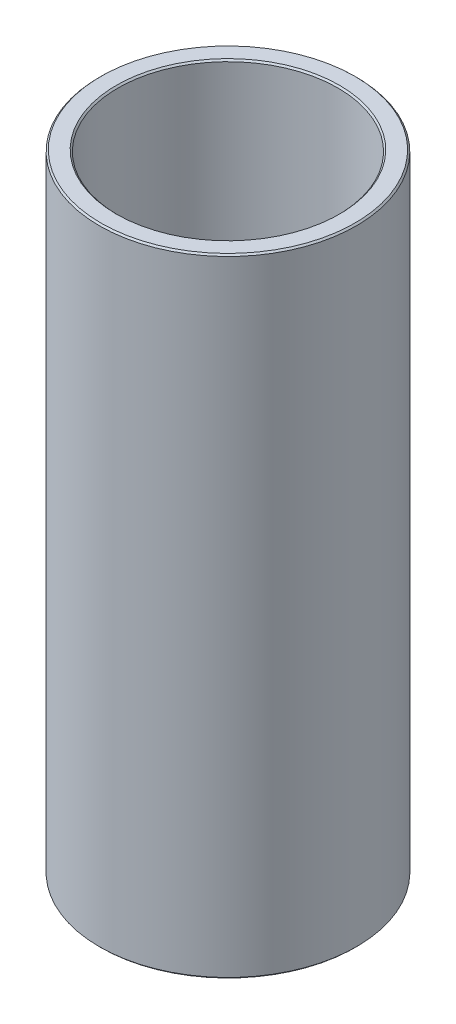
ISO-10303-21;
HEADER;
FILE_DESCRIPTION(('STEP AP214'),'2;1');
FILE_NAME('part.step','',(''),(''),'','','');
FILE_SCHEMA(('AUTOMOTIVE_DESIGN { 1 0 10303 214 1 1 1 1 }'));
ENDSEC;
DATA;
#1=APPLICATION_CONTEXT('core data for automotive mechanical design processes');
#2=APPLICATION_PROTOCOL_DEFINITION('international standard','automotive_design',2000,#1);
#3=PRODUCT_CONTEXT('',#1,'mechanical');
#4=PRODUCT('Part','Part','',(#3));
#5=PRODUCT_RELATED_PRODUCT_CATEGORY('part','',(#4));
#6=PRODUCT_DEFINITION_FORMATION('','',#4);
#7=PRODUCT_DEFINITION_CONTEXT('part definition',#1,'design');
#8=PRODUCT_DEFINITION('design','',#6,#7);
#9=PRODUCT_DEFINITION_SHAPE('','',#8);
#10=(LENGTH_UNIT() NAMED_UNIT(*) SI_UNIT(.MILLI.,.METRE.));
#11=(NAMED_UNIT(*) PLANE_ANGLE_UNIT() SI_UNIT($,.RADIAN.));
#12=(NAMED_UNIT(*) SI_UNIT($,.STERADIAN.) SOLID_ANGLE_UNIT());
#13=UNCERTAINTY_MEASURE_WITH_UNIT(LENGTH_MEASURE(1.E-05),#10,'distance_accuracy_value','');
#14=(GEOMETRIC_REPRESENTATION_CONTEXT(3) GLOBAL_UNCERTAINTY_ASSIGNED_CONTEXT((#13)) GLOBAL_UNIT_ASSIGNED_CONTEXT((#10,
#11,#12)) REPRESENTATION_CONTEXT('',''));
#15=CARTESIAN_POINT('',(0.,0.,0.));
#16=DIRECTION('',(0.,0.,1.));
#17=DIRECTION('',(1.,0.,0.));
#18=AXIS2_PLACEMENT_3D('',#15,#16,#17);
#19=CARTESIAN_POINT('',(0.,134.179458457528,0.));
#20=DIRECTION('',(0.,-1.,0.));
#21=DIRECTION('',(0.,0.,-1.));
#22=AXIS2_PLACEMENT_3D('',#19,#20,#21);
#23=CYLINDRICAL_SURFACE('',#22,27.5);
#24=CARTESIAN_POINT('',(0.,0.333730321750547,0.));
#25=DIRECTION('',(0.,1.,0.));
#26=DIRECTION('',(0.,0.,1.));
#27=AXIS2_PLACEMENT_3D('',#24,#25,#26);
#28=CIRCLE('',#27,27.5);
#29=CARTESIAN_POINT('',(0.,0.333730321750547,27.5));
#30=VERTEX_POINT('',#29);
#31=EDGE_CURVE('E10',#30,#30,#28,.T.);
#32=ORIENTED_EDGE('',*,*,#31,.T.);
#33=EDGE_LOOP('',(#32));
#34=FACE_BOUND('',#33,.T.);
#35=CARTESIAN_POINT('',(0.,133.845728135778,0.));
#36=DIRECTION('',(0.,1.,0.));
#37=DIRECTION('',(0.,0.,1.));
#38=AXIS2_PLACEMENT_3D('',#35,#36,#37);
#39=CIRCLE('',#38,27.5);
#40=CARTESIAN_POINT('',(0.,133.845728135778,27.5));
#41=VERTEX_POINT('',#40);
#42=EDGE_CURVE('E50',#41,#41,#39,.F.);
#43=ORIENTED_EDGE('',*,*,#42,.T.);
#44=EDGE_LOOP('',(#43));
#45=FACE_BOUND('',#44,.T.);
#46=ADVANCED_FACE('F39',(#34,#45),#23,.T.);
#47=CARTESIAN_POINT('',(0.,134.179458457528,0.));
#48=DIRECTION('',(0.,1.,0.));
#49=DIRECTION('',(0.,0.,1.));
#50=AXIS2_PLACEMENT_3D('',#47,#48,#49);
#51=PLANE('',#50);
#52=CARTESIAN_POINT('',(0.,134.179458457528,0.));
#53=DIRECTION('',(0.,1.,0.));
#54=DIRECTION('',(0.,0.,1.));
#55=AXIS2_PLACEMENT_3D('',#52,#53,#54);
#56=CIRCLE('',#55,23.862905061401);
#57=CARTESIAN_POINT('',(0.,134.179458457528,23.862905061401));
#58=VERTEX_POINT('',#57);
#59=EDGE_CURVE('E58',#58,#58,#56,.F.);
#60=ORIENTED_EDGE('',*,*,#59,.T.);
#61=EDGE_LOOP('',(#60));
#62=FACE_BOUND('',#61,.T.);
#63=CARTESIAN_POINT('',(0.,134.179458457528,0.));
#64=DIRECTION('',(0.,1.,0.));
#65=DIRECTION('',(0.,0.,1.));
#66=AXIS2_PLACEMENT_3D('',#63,#64,#65);
#67=CIRCLE('',#66,27.1662696782494);
#68=CARTESIAN_POINT('',(0.,134.179458457528,27.1662696782494));
#69=VERTEX_POINT('',#68);
#70=EDGE_CURVE('E61',#69,#69,#67,.T.);
#71=ORIENTED_EDGE('',*,*,#70,.T.);
#72=EDGE_LOOP('',(#71));
#73=FACE_BOUND('',#72,.T.);
#74=ADVANCED_FACE('F88',(#62,#73),#51,.T.);
#75=CARTESIAN_POINT('',(0.,0.,0.));
#76=DIRECTION('',(0.,1.,0.));
#77=DIRECTION('',(0.,0.,1.));
#78=AXIS2_PLACEMENT_3D('',#75,#76,#77);
#79=PLANE('',#78);
#80=CARTESIAN_POINT('',(0.,0.,0.));
#81=DIRECTION('',(0.,1.,0.));
#82=DIRECTION('',(0.,0.,1.));
#83=AXIS2_PLACEMENT_3D('',#80,#81,#82);
#84=CIRCLE('',#83,23.862905061401);
#85=CARTESIAN_POINT('',(0.,0.,23.862905061401));
#86=VERTEX_POINT('',#85);
#87=EDGE_CURVE('E51',#86,#86,#84,.T.);
#88=ORIENTED_EDGE('',*,*,#87,.T.);
#89=EDGE_LOOP('',(#88));
#90=FACE_BOUND('',#89,.T.);
#91=CARTESIAN_POINT('',(0.,0.,0.));
#92=DIRECTION('',(0.,1.,0.));
#93=DIRECTION('',(0.,0.,1.));
#94=AXIS2_PLACEMENT_3D('',#91,#92,#93);
#95=CIRCLE('',#94,27.1662696782495);
#96=CARTESIAN_POINT('',(0.,0.,27.1662696782495));
#97=VERTEX_POINT('',#96);
#98=EDGE_CURVE('E54',#97,#97,#95,.F.);
#99=ORIENTED_EDGE('',*,*,#98,.T.);
#100=EDGE_LOOP('',(#99));
#101=FACE_BOUND('',#100,.T.);
#102=ADVANCED_FACE('F83',(#90,#101),#79,.F.);
#103=CARTESIAN_POINT('',(0.,134.179458457528,0.));
#104=DIRECTION('',(0.,-1.,0.));
#105=DIRECTION('',(0.,0.,-1.));
#106=AXIS2_PLACEMENT_3D('',#103,#104,#105);
#107=CYLINDRICAL_SURFACE('',#106,23.5291747396505);
#108=CARTESIAN_POINT('',(0.,133.845728135778,0.));
#109=DIRECTION('',(0.,1.,0.));
#110=DIRECTION('',(0.,0.,1.));
#111=AXIS2_PLACEMENT_3D('',#108,#109,#110);
#112=CIRCLE('',#111,23.5291747396505);
#113=CARTESIAN_POINT('',(0.,133.845728135778,23.5291747396505));
#114=VERTEX_POINT('',#113);
#115=EDGE_CURVE('E67',#114,#114,#112,.T.);
#116=ORIENTED_EDGE('',*,*,#115,.T.);
#117=EDGE_LOOP('',(#116));
#118=FACE_BOUND('',#117,.T.);
#119=CARTESIAN_POINT('',(0.,0.333730321750547,0.));
#120=DIRECTION('',(0.,1.,0.));
#121=DIRECTION('',(0.,0.,1.));
#122=AXIS2_PLACEMENT_3D('',#119,#120,#121);
#123=CIRCLE('',#122,23.5291747396505);
#124=CARTESIAN_POINT('',(0.,0.333730321750547,23.5291747396505));
#125=VERTEX_POINT('',#124);
#126=EDGE_CURVE('E69',#125,#125,#123,.F.);
#127=ORIENTED_EDGE('',*,*,#126,.T.);
#128=EDGE_LOOP('',(#127));
#129=FACE_BOUND('',#128,.T.);
#130=ADVANCED_FACE('F71',(#118,#129),#107,.F.);
#131=CARTESIAN_POINT('',(0.,133.845728135778,0.));
#132=DIRECTION('',(0.,1.,0.));
#133=DIRECTION('',(0.,0.,1.));
#134=AXIS2_PLACEMENT_3D('',#131,#132,#133);
#135=CONICAL_SURFACE('',#134,23.5291747396505,0.785398163397464);
#136=ORIENTED_EDGE('',*,*,#59,.F.);
#137=EDGE_LOOP('',(#136));
#138=FACE_BOUND('',#137,.T.);
#139=ORIENTED_EDGE('',*,*,#115,.F.);
#140=EDGE_LOOP('',(#139));
#141=FACE_BOUND('',#140,.T.);
#142=ADVANCED_FACE('F77',(#138,#141),#135,.F.);
#143=CARTESIAN_POINT('',(0.,0.,0.));
#144=DIRECTION('',(0.,-1.,0.));
#145=DIRECTION('',(0.,0.,-1.));
#146=AXIS2_PLACEMENT_3D('',#143,#144,#145);
#147=CONICAL_SURFACE('',#146,23.862905061401,0.785398163397464);
#148=ORIENTED_EDGE('',*,*,#126,.F.);
#149=EDGE_LOOP('',(#148));
#150=FACE_BOUND('',#149,.T.);
#151=ORIENTED_EDGE('',*,*,#87,.F.);
#152=EDGE_LOOP('',(#151));
#153=FACE_BOUND('',#152,.T.);
#154=ADVANCED_FACE('F73',(#150,#153),#147,.F.);
#155=CARTESIAN_POINT('',(0.,0.333730321750547,0.));
#156=DIRECTION('',(0.,1.,0.));
#157=DIRECTION('',(0.,0.,1.));
#158=AXIS2_PLACEMENT_3D('',#155,#156,#157);
#159=CONICAL_SURFACE('',#158,27.5,0.785398163397433);
#160=ORIENTED_EDGE('',*,*,#98,.F.);
#161=EDGE_LOOP('',(#160));
#162=FACE_BOUND('',#161,.T.);
#163=ORIENTED_EDGE('',*,*,#31,.F.);
#164=EDGE_LOOP('',(#163));
#165=FACE_BOUND('',#164,.T.);
#166=ADVANCED_FACE('F76',(#162,#165),#159,.T.);
#167=CARTESIAN_POINT('',(0.,134.179458457528,0.));
#168=DIRECTION('',(0.,-1.,0.));
#169=DIRECTION('',(0.,0.,-1.));
#170=AXIS2_PLACEMENT_3D('',#167,#168,#169);
#171=CONICAL_SURFACE('',#170,27.1662696782494,0.785398163397459);
#172=ORIENTED_EDGE('',*,*,#42,.F.);
#173=EDGE_LOOP('',(#172));
#174=FACE_BOUND('',#173,.T.);
#175=ORIENTED_EDGE('',*,*,#70,.F.);
#176=EDGE_LOOP('',(#175));
#177=FACE_BOUND('',#176,.T.);
#178=ADVANCED_FACE('F45',(#174,#177),#171,.T.);
#179=CLOSED_SHELL('',(#46,#74,#102,#130,#142,#154,#166,#178));
#180=MANIFOLD_SOLID_BREP('B2',#179);
#181=ADVANCED_BREP_SHAPE_REPRESENTATION('',(#18,#180),#14);
#182=SHAPE_DEFINITION_REPRESENTATION(#9,#181);
ENDSEC;
END-ISO-10303-21;
